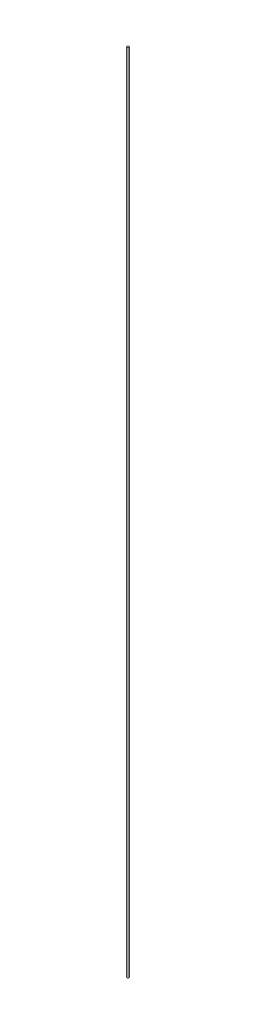
ISO-10303-21;
HEADER;
FILE_DESCRIPTION(('STEP AP214'),'2;1');
FILE_NAME('part.step','',(''),(''),'','','');
FILE_SCHEMA(('AUTOMOTIVE_DESIGN { 1 0 10303 214 1 1 1 1 }'));
ENDSEC;
DATA;
#1=APPLICATION_CONTEXT('core data for automotive mechanical design processes');
#2=APPLICATION_PROTOCOL_DEFINITION('international standard','automotive_design',2000,#1);
#3=PRODUCT_CONTEXT('',#1,'mechanical');
#4=PRODUCT('Part','Part','',(#3));
#5=PRODUCT_RELATED_PRODUCT_CATEGORY('part','',(#4));
#6=PRODUCT_DEFINITION_FORMATION('','',#4);
#7=PRODUCT_DEFINITION_CONTEXT('part definition',#1,'design');
#8=PRODUCT_DEFINITION('design','',#6,#7);
#9=PRODUCT_DEFINITION_SHAPE('','',#8);
#10=(LENGTH_UNIT() NAMED_UNIT(*) SI_UNIT(.MILLI.,.METRE.));
#11=(NAMED_UNIT(*) PLANE_ANGLE_UNIT() SI_UNIT($,.RADIAN.));
#12=(NAMED_UNIT(*) SI_UNIT($,.STERADIAN.) SOLID_ANGLE_UNIT());
#13=UNCERTAINTY_MEASURE_WITH_UNIT(LENGTH_MEASURE(1.E-05),#10,'distance_accuracy_value','');
#14=(GEOMETRIC_REPRESENTATION_CONTEXT(3) GLOBAL_UNCERTAINTY_ASSIGNED_CONTEXT((#13)) GLOBAL_UNIT_ASSIGNED_CONTEXT((#10,
#11,#12)) REPRESENTATION_CONTEXT('',''));
#15=CARTESIAN_POINT('',(0.,0.,0.));
#16=DIRECTION('',(0.,0.,1.));
#17=DIRECTION('',(1.,0.,0.));
#18=AXIS2_PLACEMENT_3D('',#15,#16,#17);
#19=CARTESIAN_POINT('',(0.,1136.65,0.));
#20=DIRECTION('',(0.,-1.,0.));
#21=DIRECTION('',(0.,0.,-1.));
#22=AXIS2_PLACEMENT_3D('',#19,#20,#21);
#23=CYLINDRICAL_SURFACE('',#22,1.27);
#24=CARTESIAN_POINT('',(0.,1136.65,0.));
#25=DIRECTION('',(0.,1.,0.));
#26=DIRECTION('',(0.,0.,1.));
#27=AXIS2_PLACEMENT_3D('',#24,#25,#26);
#28=CIRCLE('',#27,1.27);
#29=CARTESIAN_POINT('',(0.,1136.65,1.27));
#30=VERTEX_POINT('',#29);
#31=EDGE_CURVE('E10',#30,#30,#28,.T.);
#32=ORIENTED_EDGE('',*,*,#31,.F.);
#33=EDGE_LOOP('',(#32));
#34=FACE_BOUND('',#33,.T.);
#35=CARTESIAN_POINT('',(0.,0.,0.));
#36=DIRECTION('',(0.,1.,0.));
#37=DIRECTION('',(0.,0.,1.));
#38=AXIS2_PLACEMENT_3D('',#35,#36,#37);
#39=CIRCLE('',#38,1.27);
#40=CARTESIAN_POINT('',(0.,0.,1.27));
#41=VERTEX_POINT('',#40);
#42=EDGE_CURVE('E33',#41,#41,#39,.T.);
#43=ORIENTED_EDGE('',*,*,#42,.T.);
#44=EDGE_LOOP('',(#43));
#45=FACE_BOUND('',#44,.T.);
#46=ADVANCED_FACE('F30',(#34,#45),#23,.T.);
#47=CARTESIAN_POINT('',(0.,1136.65,0.));
#48=DIRECTION('',(0.,1.,0.));
#49=DIRECTION('',(0.,0.,1.));
#50=AXIS2_PLACEMENT_3D('',#47,#48,#49);
#51=PLANE('',#50);
#52=ORIENTED_EDGE('',*,*,#31,.T.);
#53=EDGE_LOOP('',(#52));
#54=FACE_BOUND('',#53,.T.);
#55=ADVANCED_FACE('F45',(#54),#51,.T.);
#56=CARTESIAN_POINT('',(0.,0.,0.));
#57=DIRECTION('',(0.,1.,0.));
#58=DIRECTION('',(0.,0.,1.));
#59=AXIS2_PLACEMENT_3D('',#56,#57,#58);
#60=PLANE('',#59);
#61=ORIENTED_EDGE('',*,*,#42,.F.);
#62=EDGE_LOOP('',(#61));
#63=FACE_BOUND('',#62,.T.);
#64=ADVANCED_FACE('F43',(#63),#60,.F.);
#65=CLOSED_SHELL('',(#46,#55,#64));
#66=MANIFOLD_SOLID_BREP('B2',#65);
#67=ADVANCED_BREP_SHAPE_REPRESENTATION('',(#18,#66),#14);
#68=SHAPE_DEFINITION_REPRESENTATION(#9,#67);
ENDSEC;
END-ISO-10303-21;
